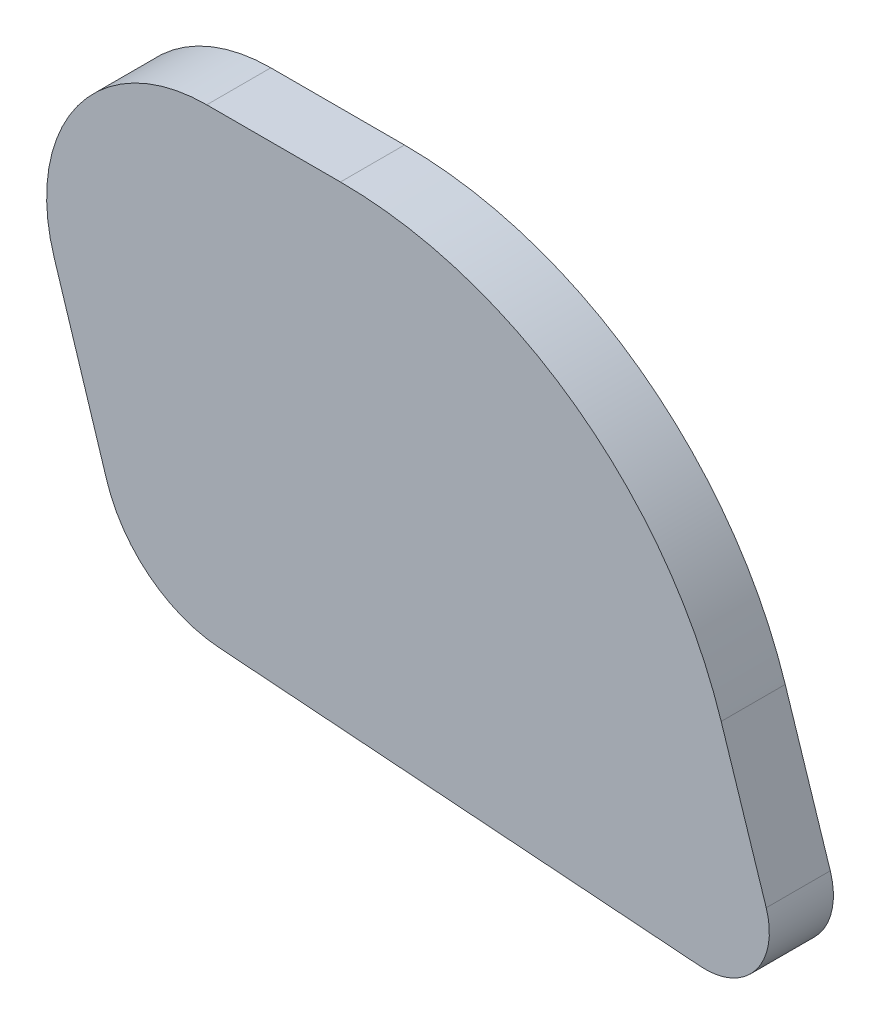
ISO-10303-21;
HEADER;
FILE_DESCRIPTION(('STEP AP214'),'2;1');
FILE_NAME('part.step','',(''),(''),'','','');
FILE_SCHEMA(('AUTOMOTIVE_DESIGN { 1 0 10303 214 1 1 1 1 }'));
ENDSEC;
DATA;
#1=APPLICATION_CONTEXT('core data for automotive mechanical design processes');
#2=APPLICATION_PROTOCOL_DEFINITION('international standard','automotive_design',2000,#1);
#3=PRODUCT_CONTEXT('',#1,'mechanical');
#4=PRODUCT('Part','Part','',(#3));
#5=PRODUCT_RELATED_PRODUCT_CATEGORY('part','',(#4));
#6=PRODUCT_DEFINITION_FORMATION('','',#4);
#7=PRODUCT_DEFINITION_CONTEXT('part definition',#1,'design');
#8=PRODUCT_DEFINITION('design','',#6,#7);
#9=PRODUCT_DEFINITION_SHAPE('','',#8);
#10=(LENGTH_UNIT() NAMED_UNIT(*) SI_UNIT(.MILLI.,.METRE.));
#11=(NAMED_UNIT(*) PLANE_ANGLE_UNIT() SI_UNIT($,.RADIAN.));
#12=(NAMED_UNIT(*) SI_UNIT($,.STERADIAN.) SOLID_ANGLE_UNIT());
#13=UNCERTAINTY_MEASURE_WITH_UNIT(LENGTH_MEASURE(1.E-05),#10,'distance_accuracy_value','');
#14=(GEOMETRIC_REPRESENTATION_CONTEXT(3) GLOBAL_UNCERTAINTY_ASSIGNED_CONTEXT((#13)) GLOBAL_UNIT_ASSIGNED_CONTEXT((#10,
#11,#12)) REPRESENTATION_CONTEXT('',''));
#15=CARTESIAN_POINT('',(0.,0.,0.));
#16=DIRECTION('',(0.,0.,1.));
#17=DIRECTION('',(1.,0.,0.));
#18=AXIS2_PLACEMENT_3D('',#15,#16,#17);
#19=CARTESIAN_POINT('',(153.759174181085,199.193966883318,3.41935483870968));
#20=DIRECTION('',(0.,0.,-1.));
#21=DIRECTION('',(-1.,0.,0.));
#22=AXIS2_PLACEMENT_3D('',#19,#20,#21);
#23=CYLINDRICAL_SURFACE('',#22,7.09677419354839);
#24=CARTESIAN_POINT('',(153.759174181085,199.193966883318,0.580645161290323));
#25=DIRECTION('',(0.,0.,1.));
#26=DIRECTION('',(1.,0.,0.));
#27=AXIS2_PLACEMENT_3D('',#24,#25,#26);
#28=CIRCLE('',#27,7.09677419354839);
#29=CARTESIAN_POINT('',(153.759174181085,206.290741076866,0.580645161290323));
#30=VERTEX_POINT('',#29);
#31=CARTESIAN_POINT('',(146.991473607901,197.057981652578,0.580645161290323));
#32=VERTEX_POINT('',#31);
#33=EDGE_CURVE('E131',#30,#32,#28,.T.);
#34=ORIENTED_EDGE('',*,*,#33,.T.);
#35=DIRECTION('',(0.,0.,-1.));
#36=VECTOR('',#35,1.);
#37=CARTESIAN_POINT('',(146.991473607901,197.057981652578,3.41935483870968));
#38=LINE('',#37,#36);
#39=CARTESIAN_POINT('',(146.991473607901,197.057981652578,3.41935483870968));
#40=VERTEX_POINT('',#39);
#41=EDGE_CURVE('E11',#40,#32,#38,.T.);
#42=ORIENTED_EDGE('',*,*,#41,.F.);
#43=CARTESIAN_POINT('',(153.759174181085,199.193966883318,3.41935483870968));
#44=DIRECTION('',(0.,0.,1.));
#45=DIRECTION('',(1.,0.,0.));
#46=AXIS2_PLACEMENT_3D('',#43,#44,#45);
#47=CIRCLE('',#46,7.09677419354839);
#48=CARTESIAN_POINT('',(153.759174181085,206.290741076866,3.41935483870968));
#49=VERTEX_POINT('',#48);
#50=EDGE_CURVE('E145',#49,#40,#47,.T.);
#51=ORIENTED_EDGE('',*,*,#50,.F.);
#52=DIRECTION('',(0.,0.,-1.));
#53=VECTOR('',#52,1.);
#54=CARTESIAN_POINT('',(153.759174181085,206.290741076866,3.41935483870968));
#55=LINE('',#54,#53);
#56=EDGE_CURVE('E127',#49,#30,#55,.T.);
#57=ORIENTED_EDGE('',*,*,#56,.T.);
#58=EDGE_LOOP('',(#34,#42,#51,#57));
#59=FACE_BOUND('',#58,.T.);
#60=ADVANCED_FACE('F35',(#59),#23,.T.);
#61=CARTESIAN_POINT('',(149.320437770449,189.678842569136,3.41935483870968));
#62=DIRECTION('',(0.953630535312325,0.300979737058706,0.));
#63=DIRECTION('',(-0.300979737058706,0.953630535312325,0.));
#64=AXIS2_PLACEMENT_3D('',#61,#62,#63);
#65=PLANE('',#64);
#66=DIRECTION('',(0.300979737058706,-0.953630535312325,0.));
#67=VECTOR('',#66,1.);
#68=CARTESIAN_POINT('',(149.320437770449,189.678842569136,0.580645161290323));
#69=LINE('',#68,#67);
#70=CARTESIAN_POINT('',(149.320437770449,189.678842569136,0.580645161290323));
#71=VERTEX_POINT('',#70);
#72=EDGE_CURVE('E134',#32,#71,#69,.T.);
#73=ORIENTED_EDGE('',*,*,#72,.T.);
#74=DIRECTION('',(0.,0.,-1.));
#75=VECTOR('',#74,1.);
#76=CARTESIAN_POINT('',(149.320437770449,189.678842569136,3.41935483870968));
#77=LINE('',#76,#75);
#78=CARTESIAN_POINT('',(149.320437770449,189.678842569136,3.41935483870968));
#79=VERTEX_POINT('',#78);
#80=EDGE_CURVE('E43',#79,#71,#77,.T.);
#81=ORIENTED_EDGE('',*,*,#80,.F.);
#82=DIRECTION('',(0.300979737058706,-0.953630535312325,0.));
#83=VECTOR('',#82,1.);
#84=CARTESIAN_POINT('',(149.320437770449,189.678842569136,3.41935483870968));
#85=LINE('',#84,#83);
#86=EDGE_CURVE('E94',#40,#79,#85,.T.);
#87=ORIENTED_EDGE('',*,*,#86,.F.);
#88=ORIENTED_EDGE('',*,*,#41,.T.);
#89=EDGE_LOOP('',(#73,#81,#87,#88));
#90=FACE_BOUND('',#89,.T.);
#91=ADVANCED_FACE('F180',(#90),#65,.F.);
#92=CARTESIAN_POINT('',(154.734598228996,191.387630753728,3.41935483870968));
#93=DIRECTION('',(0.,0.,-1.));
#94=DIRECTION('',(-1.,0.,0.));
#95=AXIS2_PLACEMENT_3D('',#92,#93,#94);
#96=CYLINDRICAL_SURFACE('',#95,5.67741935483872);
#97=CARTESIAN_POINT('',(154.734598228996,191.387630753728,0.580645161290323));
#98=DIRECTION('',(0.,0.,1.));
#99=DIRECTION('',(-1.,0.,0.));
#100=AXIS2_PLACEMENT_3D('',#97,#98,#99);
#101=CIRCLE('',#100,5.67741935483872);
#102=CARTESIAN_POINT('',(154.319024692685,185.725441321484,0.580645161290323));
#103=VERTEX_POINT('',#102);
#104=EDGE_CURVE('E136',#71,#103,#101,.T.);
#105=ORIENTED_EDGE('',*,*,#104,.T.);
#106=DIRECTION('',(0.,0.,-1.));
#107=VECTOR('',#106,1.);
#108=CARTESIAN_POINT('',(154.319024692685,185.725441321484,3.41935483870968));
#109=LINE('',#108,#107);
#110=CARTESIAN_POINT('',(154.319024692685,185.725441321484,3.41935483870968));
#111=VERTEX_POINT('',#110);
#112=EDGE_CURVE('E152',#111,#103,#109,.T.);
#113=ORIENTED_EDGE('',*,*,#112,.F.);
#114=CARTESIAN_POINT('',(154.734598228996,191.387630753728,3.41935483870968));
#115=DIRECTION('',(0.,0.,1.));
#116=DIRECTION('',(-1.,0.,0.));
#117=AXIS2_PLACEMENT_3D('',#114,#115,#116);
#118=CIRCLE('',#117,5.67741935483872);
#119=EDGE_CURVE('E160',#79,#111,#118,.T.);
#120=ORIENTED_EDGE('',*,*,#119,.F.);
#121=ORIENTED_EDGE('',*,*,#80,.T.);
#122=EDGE_LOOP('',(#105,#113,#120,#121));
#123=FACE_BOUND('',#122,.T.);
#124=ADVANCED_FACE('F158',(#123),#96,.T.);
#125=CARTESIAN_POINT('',(175.649487579309,184.159902760998,3.41935483870968));
#126=DIRECTION('',(0.0731976115094085,0.997317456815691,0.));
#127=DIRECTION('',(-0.997317456815691,0.0731976115094085,0.));
#128=AXIS2_PLACEMENT_3D('',#125,#126,#127);
#129=PLANE('',#128);
#130=DIRECTION('',(0.997317456815691,-0.0731976115094085,0.));
#131=VECTOR('',#130,1.);
#132=CARTESIAN_POINT('',(175.649487579309,184.159902760998,0.580645161290323));
#133=LINE('',#132,#131);
#134=CARTESIAN_POINT('',(175.649487579309,184.159902760998,0.580645161290323));
#135=VERTEX_POINT('',#134);
#136=EDGE_CURVE('E138',#103,#135,#133,.T.);
#137=ORIENTED_EDGE('',*,*,#136,.T.);
#138=DIRECTION('',(0.,0.,-1.));
#139=VECTOR('',#138,1.);
#140=CARTESIAN_POINT('',(175.649487579309,184.159902760998,3.41935483870968));
#141=LINE('',#140,#139);
#142=CARTESIAN_POINT('',(175.649487579309,184.159902760998,3.41935483870968));
#143=VERTEX_POINT('',#142);
#144=EDGE_CURVE('E149',#143,#135,#141,.T.);
#145=ORIENTED_EDGE('',*,*,#144,.F.);
#146=DIRECTION('',(0.997317456815691,-0.0731976115094085,0.));
#147=VECTOR('',#146,1.);
#148=CARTESIAN_POINT('',(175.649487579309,184.159902760998,3.41935483870968));
#149=LINE('',#148,#147);
#150=EDGE_CURVE('E172',#111,#143,#149,.T.);
#151=ORIENTED_EDGE('',*,*,#150,.F.);
#152=ORIENTED_EDGE('',*,*,#112,.T.);
#153=EDGE_LOOP('',(#137,#145,#151,#152));
#154=FACE_BOUND('',#153,.T.);
#155=ADVANCED_FACE('F168',(#154),#129,.F.);
#156=CARTESIAN_POINT('',(175.857274347465,186.990997477119,3.41935483870968));
#157=DIRECTION('',(0.,0.,-1.));
#158=DIRECTION('',(-1.,0.,0.));
#159=AXIS2_PLACEMENT_3D('',#156,#157,#158);
#160=CYLINDRICAL_SURFACE('',#159,2.83870967741936);
#161=CARTESIAN_POINT('',(175.857274347465,186.990997477119,0.580645161290323));
#162=DIRECTION('',(0.,0.,1.));
#163=DIRECTION('',(-1.,0.,0.));
#164=AXIS2_PLACEMENT_3D('',#161,#162,#163);
#165=CIRCLE('',#164,2.83870967741936);
#166=CARTESIAN_POINT('',(178.557519768997,187.866752748968,0.580645161290323));
#167=VERTEX_POINT('',#166);
#168=EDGE_CURVE('E140',#135,#167,#165,.T.);
#169=ORIENTED_EDGE('',*,*,#168,.T.);
#170=DIRECTION('',(0.,0.,-1.));
#171=VECTOR('',#170,1.);
#172=CARTESIAN_POINT('',(178.557519768997,187.866752748968,3.41935483870968));
#173=LINE('',#172,#171);
#174=CARTESIAN_POINT('',(178.557519768997,187.866752748968,3.41935483870968));
#175=VERTEX_POINT('',#174);
#176=EDGE_CURVE('E122',#175,#167,#173,.T.);
#177=ORIENTED_EDGE('',*,*,#176,.F.);
#178=CARTESIAN_POINT('',(175.857274347465,186.990997477119,3.41935483870968));
#179=DIRECTION('',(0.,0.,1.));
#180=DIRECTION('',(-1.,0.,0.));
#181=AXIS2_PLACEMENT_3D('',#178,#179,#180);
#182=CIRCLE('',#181,2.83870967741936);
#183=EDGE_CURVE('E113',#143,#175,#182,.T.);
#184=ORIENTED_EDGE('',*,*,#183,.F.);
#185=ORIENTED_EDGE('',*,*,#144,.T.);
#186=EDGE_LOOP('',(#169,#177,#184,#185));
#187=FACE_BOUND('',#186,.T.);
#188=ADVANCED_FACE('F171',(#187),#160,.T.);
#189=CARTESIAN_POINT('',(176.561133836106,194.022276042046,3.41935483870968));
#190=DIRECTION('',(-0.951222818948763,-0.308504698037437,0.));
#191=DIRECTION('',(0.308504698037437,-0.951222818948762,0.));
#192=AXIS2_PLACEMENT_3D('',#189,#190,#191);
#193=PLANE('',#192);
#194=DIRECTION('',(-0.308504698037437,0.951222818948762,0.));
#195=VECTOR('',#194,1.);
#196=CARTESIAN_POINT('',(176.561133836106,194.022276042046,0.580645161290323));
#197=LINE('',#196,#195);
#198=CARTESIAN_POINT('',(176.561133836106,194.022276042046,0.580645161290323));
#199=VERTEX_POINT('',#198);
#200=EDGE_CURVE('E121',#167,#199,#197,.T.);
#201=ORIENTED_EDGE('',*,*,#200,.T.);
#202=DIRECTION('',(0.,0.,-1.));
#203=VECTOR('',#202,1.);
#204=CARTESIAN_POINT('',(176.561133836106,194.022276042046,3.41935483870968));
#205=LINE('',#204,#203);
#206=CARTESIAN_POINT('',(176.561133836106,194.022276042046,3.41935483870968));
#207=VERTEX_POINT('',#206);
#208=EDGE_CURVE('E118',#207,#199,#205,.T.);
#209=ORIENTED_EDGE('',*,*,#208,.F.);
#210=DIRECTION('',(-0.308504698037437,0.951222818948762,0.));
#211=VECTOR('',#210,1.);
#212=CARTESIAN_POINT('',(176.561133836106,194.022276042046,3.41935483870968));
#213=LINE('',#212,#211);
#214=EDGE_CURVE('E107',#175,#207,#213,.T.);
#215=ORIENTED_EDGE('',*,*,#214,.F.);
#216=ORIENTED_EDGE('',*,*,#176,.T.);
#217=EDGE_LOOP('',(#201,#209,#215,#216));
#218=FACE_BOUND('',#217,.T.);
#219=ADVANCED_FACE('F119',(#218),#193,.F.);
#220=CARTESIAN_POINT('',(159.684599951531,188.548805592995,3.41935483870968));
#221=DIRECTION('',(0.,0.,-1.));
#222=DIRECTION('',(-1.,0.,0.));
#223=AXIS2_PLACEMENT_3D('',#220,#221,#222);
#224=CYLINDRICAL_SURFACE('',#223,17.741935483871);
#225=CARTESIAN_POINT('',(159.684599951531,188.548805592995,0.580645161290323));
#226=DIRECTION('',(0.,0.,1.));
#227=DIRECTION('',(-1.,0.,0.));
#228=AXIS2_PLACEMENT_3D('',#225,#226,#227);
#229=CIRCLE('',#228,17.741935483871);
#230=CARTESIAN_POINT('',(159.684599951531,206.290741076866,0.580645161290323));
#231=VERTEX_POINT('',#230);
#232=EDGE_CURVE('E80',#199,#231,#229,.T.);
#233=ORIENTED_EDGE('',*,*,#232,.T.);
#234=DIRECTION('',(0.,0.,-1.));
#235=VECTOR('',#234,1.);
#236=CARTESIAN_POINT('',(159.684599951531,206.290741076866,3.41935483870968));
#237=LINE('',#236,#235);
#238=CARTESIAN_POINT('',(159.684599951531,206.290741076866,3.41935483870968));
#239=VERTEX_POINT('',#238);
#240=EDGE_CURVE('E123',#239,#231,#237,.T.);
#241=ORIENTED_EDGE('',*,*,#240,.F.);
#242=CARTESIAN_POINT('',(159.684599951531,188.548805592995,3.41935483870968));
#243=DIRECTION('',(0.,0.,1.));
#244=DIRECTION('',(-1.,0.,0.));
#245=AXIS2_PLACEMENT_3D('',#242,#243,#244);
#246=CIRCLE('',#245,17.741935483871);
#247=EDGE_CURVE('E111',#207,#239,#246,.T.);
#248=ORIENTED_EDGE('',*,*,#247,.F.);
#249=ORIENTED_EDGE('',*,*,#208,.T.);
#250=EDGE_LOOP('',(#233,#241,#248,#249));
#251=FACE_BOUND('',#250,.T.);
#252=ADVANCED_FACE('F125',(#251),#224,.T.);
#253=CARTESIAN_POINT('',(153.759174181085,206.290741076866,3.41935483870968));
#254=DIRECTION('',(0.,-1.,0.));
#255=DIRECTION('',(0.,0.,-1.));
#256=AXIS2_PLACEMENT_3D('',#253,#254,#255);
#257=PLANE('',#256);
#258=DIRECTION('',(-1.,0.,0.));
#259=VECTOR('',#258,1.);
#260=CARTESIAN_POINT('',(153.759174181085,206.290741076866,0.580645161290323));
#261=LINE('',#260,#259);
#262=EDGE_CURVE('E86',#231,#30,#261,.T.);
#263=ORIENTED_EDGE('',*,*,#262,.T.);
#264=ORIENTED_EDGE('',*,*,#56,.F.);
#265=DIRECTION('',(-1.,0.,0.));
#266=VECTOR('',#265,1.);
#267=CARTESIAN_POINT('',(153.759174181085,206.290741076866,3.41935483870968));
#268=LINE('',#267,#266);
#269=EDGE_CURVE('E51',#239,#49,#268,.T.);
#270=ORIENTED_EDGE('',*,*,#269,.F.);
#271=ORIENTED_EDGE('',*,*,#240,.T.);
#272=EDGE_LOOP('',(#263,#264,#270,#271));
#273=FACE_BOUND('',#272,.T.);
#274=ADVANCED_FACE('F196',(#273),#257,.F.);
#275=CARTESIAN_POINT('',(153.759174181085,199.193966883318,3.41935483870968));
#276=DIRECTION('',(0.,0.,1.));
#277=DIRECTION('',(1.,0.,0.));
#278=AXIS2_PLACEMENT_3D('',#275,#276,#277);
#279=PLANE('',#278);
#280=ORIENTED_EDGE('',*,*,#50,.T.);
#281=ORIENTED_EDGE('',*,*,#86,.T.);
#282=ORIENTED_EDGE('',*,*,#119,.T.);
#283=ORIENTED_EDGE('',*,*,#150,.T.);
#284=ORIENTED_EDGE('',*,*,#183,.T.);
#285=ORIENTED_EDGE('',*,*,#214,.T.);
#286=ORIENTED_EDGE('',*,*,#247,.T.);
#287=ORIENTED_EDGE('',*,*,#269,.T.);
#288=EDGE_LOOP('',(#280,#281,#282,#283,#284,#285,#286,#287));
#289=FACE_BOUND('',#288,.T.);
#290=ADVANCED_FACE('F109',(#289),#279,.T.);
#291=CARTESIAN_POINT('',(153.759174181085,199.193966883318,0.580645161290323));
#292=DIRECTION('',(0.,0.,1.));
#293=DIRECTION('',(1.,0.,0.));
#294=AXIS2_PLACEMENT_3D('',#291,#292,#293);
#295=PLANE('',#294);
#296=ORIENTED_EDGE('',*,*,#33,.F.);
#297=ORIENTED_EDGE('',*,*,#262,.F.);
#298=ORIENTED_EDGE('',*,*,#232,.F.);
#299=ORIENTED_EDGE('',*,*,#200,.F.);
#300=ORIENTED_EDGE('',*,*,#168,.F.);
#301=ORIENTED_EDGE('',*,*,#136,.F.);
#302=ORIENTED_EDGE('',*,*,#104,.F.);
#303=ORIENTED_EDGE('',*,*,#72,.F.);
#304=EDGE_LOOP('',(#296,#297,#298,#299,#300,#301,#302,#303));
#305=FACE_BOUND('',#304,.T.);
#306=ADVANCED_FACE('F164',(#305),#295,.F.);
#307=CLOSED_SHELL('',(#60,#91,#124,#155,#188,#219,#252,#274,#290,#306));
#308=MANIFOLD_SOLID_BREP('B2',#307);
#309=ADVANCED_BREP_SHAPE_REPRESENTATION('',(#18,#308),#14);
#310=SHAPE_DEFINITION_REPRESENTATION(#9,#309);
ENDSEC;
END-ISO-10303-21;
